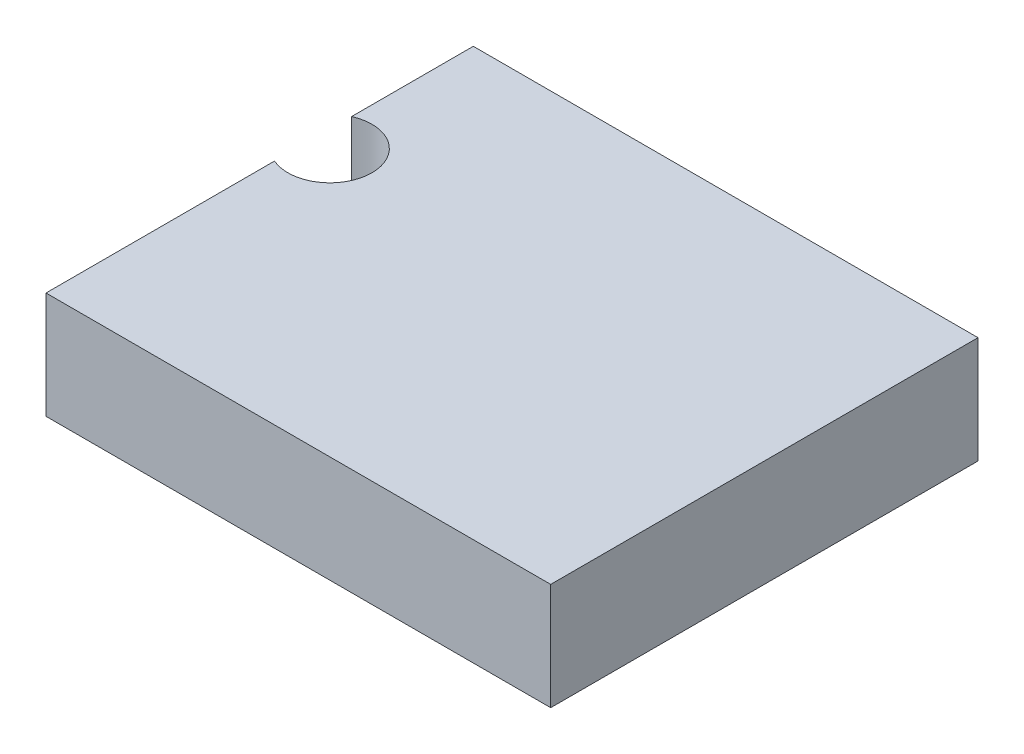
ISO-10303-21;
HEADER;
FILE_DESCRIPTION(('STEP AP214'),'2;1');
FILE_NAME('part.step','',(''),(''),'','','');
FILE_SCHEMA(('AUTOMOTIVE_DESIGN { 1 0 10303 214 1 1 1 1 }'));
ENDSEC;
DATA;
#1=APPLICATION_CONTEXT('core data for automotive mechanical design processes');
#2=APPLICATION_PROTOCOL_DEFINITION('international standard','automotive_design',2000,#1);
#3=PRODUCT_CONTEXT('',#1,'mechanical');
#4=PRODUCT('Part','Part','',(#3));
#5=PRODUCT_RELATED_PRODUCT_CATEGORY('part','',(#4));
#6=PRODUCT_DEFINITION_FORMATION('','',#4);
#7=PRODUCT_DEFINITION_CONTEXT('part definition',#1,'design');
#8=PRODUCT_DEFINITION('design','',#6,#7);
#9=PRODUCT_DEFINITION_SHAPE('','',#8);
#10=(LENGTH_UNIT() NAMED_UNIT(*) SI_UNIT(.MILLI.,.METRE.));
#11=(NAMED_UNIT(*) PLANE_ANGLE_UNIT() SI_UNIT($,.RADIAN.));
#12=(NAMED_UNIT(*) SI_UNIT($,.STERADIAN.) SOLID_ANGLE_UNIT());
#13=UNCERTAINTY_MEASURE_WITH_UNIT(LENGTH_MEASURE(1.E-05),#10,'distance_accuracy_value','');
#14=(GEOMETRIC_REPRESENTATION_CONTEXT(3) GLOBAL_UNCERTAINTY_ASSIGNED_CONTEXT((#13)) GLOBAL_UNIT_ASSIGNED_CONTEXT((#10,
#11,#12)) REPRESENTATION_CONTEXT('',''));
#15=CARTESIAN_POINT('',(0.,0.,0.));
#16=DIRECTION('',(0.,0.,1.));
#17=DIRECTION('',(1.,0.,0.));
#18=AXIS2_PLACEMENT_3D('',#15,#16,#17);
#19=CARTESIAN_POINT('',(-15.,6.35,12.7));
#20=DIRECTION('',(1.,0.,0.));
#21=DIRECTION('',(0.,0.,-1.));
#22=AXIS2_PLACEMENT_3D('',#19,#20,#21);
#23=PLANE('',#22);
#24=DIRECTION('',(0.,0.,1.));
#25=VECTOR('',#24,1.);
#26=CARTESIAN_POINT('',(-15.,0.,12.7));
#27=LINE('',#26,#25);
#28=CARTESIAN_POINT('',(-15.,0.,-12.7));
#29=VERTEX_POINT('',#28);
#30=CARTESIAN_POINT('',(-15.,0.,-5.46628784747792));
#31=VERTEX_POINT('',#30);
#32=EDGE_CURVE('E110',#29,#31,#27,.T.);
#33=ORIENTED_EDGE('',*,*,#32,.T.);
#34=DIRECTION('',(0.,1.,0.));
#35=VECTOR('',#34,1.);
#36=CARTESIAN_POINT('',(-15.,0.,-5.46628784747792));
#37=LINE('',#36,#35);
#38=CARTESIAN_POINT('',(-15.,6.35,-5.46628784747792));
#39=VERTEX_POINT('',#38);
#40=EDGE_CURVE('E47',#31,#39,#37,.T.);
#41=ORIENTED_EDGE('',*,*,#40,.T.);
#42=DIRECTION('',(0.,0.,1.));
#43=VECTOR('',#42,1.);
#44=CARTESIAN_POINT('',(-15.,6.35,12.7));
#45=LINE('',#44,#43);
#46=CARTESIAN_POINT('',(-15.,6.35,-12.7));
#47=VERTEX_POINT('',#46);
#48=EDGE_CURVE('E133',#47,#39,#45,.T.);
#49=ORIENTED_EDGE('',*,*,#48,.F.);
#50=DIRECTION('',(0.,-1.,0.));
#51=VECTOR('',#50,1.);
#52=CARTESIAN_POINT('',(-15.,6.35,-12.7));
#53=LINE('',#52,#51);
#54=EDGE_CURVE('E123',#47,#29,#53,.T.);
#55=ORIENTED_EDGE('',*,*,#54,.T.);
#56=EDGE_LOOP('',(#33,#41,#49,#55));
#57=FACE_BOUND('',#56,.T.);
#58=ADVANCED_FACE('F33',(#57),#23,.F.);
#59=CARTESIAN_POINT('',(15.,6.35,12.7));
#60=DIRECTION('',(-1.,0.,0.));
#61=DIRECTION('',(0.,0.,1.));
#62=AXIS2_PLACEMENT_3D('',#59,#60,#61);
#63=PLANE('',#62);
#64=DIRECTION('',(0.,0.,-1.));
#65=VECTOR('',#64,1.);
#66=CARTESIAN_POINT('',(15.,0.,12.7));
#67=LINE('',#66,#65);
#68=CARTESIAN_POINT('',(15.,0.,12.7));
#69=VERTEX_POINT('',#68);
#70=CARTESIAN_POINT('',(15.,0.,-12.7));
#71=VERTEX_POINT('',#70);
#72=EDGE_CURVE('E113',#69,#71,#67,.T.);
#73=ORIENTED_EDGE('',*,*,#72,.T.);
#74=DIRECTION('',(0.,-1.,0.));
#75=VECTOR('',#74,1.);
#76=CARTESIAN_POINT('',(15.,6.35,-12.7));
#77=LINE('',#76,#75);
#78=CARTESIAN_POINT('',(15.,6.35,-12.7));
#79=VERTEX_POINT('',#78);
#80=EDGE_CURVE('E41',#79,#71,#77,.T.);
#81=ORIENTED_EDGE('',*,*,#80,.F.);
#82=DIRECTION('',(0.,0.,-1.));
#83=VECTOR('',#82,1.);
#84=CARTESIAN_POINT('',(15.,6.35,12.7));
#85=LINE('',#84,#83);
#86=CARTESIAN_POINT('',(15.,6.35,12.7));
#87=VERTEX_POINT('',#86);
#88=EDGE_CURVE('E118',#87,#79,#85,.T.);
#89=ORIENTED_EDGE('',*,*,#88,.F.);
#90=DIRECTION('',(0.,-1.,0.));
#91=VECTOR('',#90,1.);
#92=CARTESIAN_POINT('',(15.,6.35,12.7));
#93=LINE('',#92,#91);
#94=EDGE_CURVE('E119',#87,#69,#93,.T.);
#95=ORIENTED_EDGE('',*,*,#94,.T.);
#96=EDGE_LOOP('',(#73,#81,#89,#95));
#97=FACE_BOUND('',#96,.T.);
#98=ADVANCED_FACE('F35',(#97),#63,.F.);
#99=CARTESIAN_POINT('',(-15.,6.35,-12.7));
#100=DIRECTION('',(0.,0.,1.));
#101=DIRECTION('',(1.,0.,0.));
#102=AXIS2_PLACEMENT_3D('',#99,#100,#101);
#103=PLANE('',#102);
#104=DIRECTION('',(-1.,0.,0.));
#105=VECTOR('',#104,1.);
#106=CARTESIAN_POINT('',(-15.,0.,-12.7));
#107=LINE('',#106,#105);
#108=EDGE_CURVE('E111',#71,#29,#107,.T.);
#109=ORIENTED_EDGE('',*,*,#108,.T.);
#110=ORIENTED_EDGE('',*,*,#54,.F.);
#111=DIRECTION('',(-1.,0.,0.));
#112=VECTOR('',#111,1.);
#113=CARTESIAN_POINT('',(-15.,6.35,-12.7));
#114=LINE('',#113,#112);
#115=EDGE_CURVE('E85',#79,#47,#114,.T.);
#116=ORIENTED_EDGE('',*,*,#115,.F.);
#117=ORIENTED_EDGE('',*,*,#80,.T.);
#118=EDGE_LOOP('',(#109,#110,#116,#117));
#119=FACE_BOUND('',#118,.T.);
#120=ADVANCED_FACE('F127',(#119),#103,.F.);
#121=CARTESIAN_POINT('',(-15.,6.35,-0.883712152522083));
#122=VERTEX_POINT('',#121);
#123=CARTESIAN_POINT('',(-15.,6.35,12.7));
#124=VERTEX_POINT('',#123);
#125=EDGE_CURVE('E105',#122,#124,#45,.T.);
#126=ORIENTED_EDGE('',*,*,#125,.F.);
#127=DIRECTION('',(0.,1.,0.));
#128=VECTOR('',#127,1.);
#129=CARTESIAN_POINT('',(-15.,0.,-0.883712152522083));
#130=LINE('',#129,#128);
#131=CARTESIAN_POINT('',(-15.,0.,-0.883712152522083));
#132=VERTEX_POINT('',#131);
#133=EDGE_CURVE('E94',#122,#132,#130,.F.);
#134=ORIENTED_EDGE('',*,*,#133,.T.);
#135=CARTESIAN_POINT('',(-15.,0.,12.7));
#136=VERTEX_POINT('',#135);
#137=EDGE_CURVE('E104',#132,#136,#27,.T.);
#138=ORIENTED_EDGE('',*,*,#137,.T.);
#139=DIRECTION('',(0.,-1.,0.));
#140=VECTOR('',#139,1.);
#141=CARTESIAN_POINT('',(-15.,6.35,12.7));
#142=LINE('',#141,#140);
#143=EDGE_CURVE('E121',#124,#136,#142,.T.);
#144=ORIENTED_EDGE('',*,*,#143,.F.);
#145=EDGE_LOOP('',(#126,#134,#138,#144));
#146=FACE_BOUND('',#145,.T.);
#147=ADVANCED_FACE('F102',(#146),#23,.F.);
#148=CARTESIAN_POINT('',(-15.,6.35,12.7));
#149=DIRECTION('',(0.,0.,-1.));
#150=DIRECTION('',(-1.,0.,0.));
#151=AXIS2_PLACEMENT_3D('',#148,#149,#150);
#152=PLANE('',#151);
#153=DIRECTION('',(1.,0.,0.));
#154=VECTOR('',#153,1.);
#155=CARTESIAN_POINT('',(-15.,0.,12.7));
#156=LINE('',#155,#154);
#157=EDGE_CURVE('E77',#136,#69,#156,.T.);
#158=ORIENTED_EDGE('',*,*,#157,.T.);
#159=ORIENTED_EDGE('',*,*,#94,.F.);
#160=DIRECTION('',(1.,0.,0.));
#161=VECTOR('',#160,1.);
#162=CARTESIAN_POINT('',(-15.,6.35,12.7));
#163=LINE('',#162,#161);
#164=EDGE_CURVE('E56',#124,#87,#163,.T.);
#165=ORIENTED_EDGE('',*,*,#164,.F.);
#166=ORIENTED_EDGE('',*,*,#143,.T.);
#167=EDGE_LOOP('',(#158,#159,#165,#166));
#168=FACE_BOUND('',#167,.T.);
#169=ADVANCED_FACE('F142',(#168),#152,.F.);
#170=CARTESIAN_POINT('',(0.,6.35,0.));
#171=DIRECTION('',(0.,-1.,0.));
#172=DIRECTION('',(0.,0.,-1.));
#173=AXIS2_PLACEMENT_3D('',#170,#171,#172);
#174=PLANE('',#173);
#175=ORIENTED_EDGE('',*,*,#48,.T.);
#176=CARTESIAN_POINT('',(-14.,6.35,-3.175));
#177=DIRECTION('',(0.,1.,0.));
#178=DIRECTION('',(0.,0.,1.));
#179=AXIS2_PLACEMENT_3D('',#176,#177,#178);
#180=CIRCLE('',#179,2.5);
#181=EDGE_CURVE('E106',#122,#39,#180,.T.);
#182=ORIENTED_EDGE('',*,*,#181,.F.);
#183=ORIENTED_EDGE('',*,*,#125,.T.);
#184=ORIENTED_EDGE('',*,*,#164,.T.);
#185=ORIENTED_EDGE('',*,*,#88,.T.);
#186=ORIENTED_EDGE('',*,*,#115,.T.);
#187=EDGE_LOOP('',(#175,#182,#183,#184,#185,#186));
#188=FACE_BOUND('',#187,.T.);
#189=ADVANCED_FACE('F140',(#188),#174,.F.);
#190=CARTESIAN_POINT('',(0.,0.,0.));
#191=DIRECTION('',(0.,-1.,0.));
#192=DIRECTION('',(0.,0.,-1.));
#193=AXIS2_PLACEMENT_3D('',#190,#191,#192);
#194=PLANE('',#193);
#195=CARTESIAN_POINT('',(-14.,0.,-3.175));
#196=DIRECTION('',(0.,-1.,0.));
#197=DIRECTION('',(0.,0.,-1.));
#198=AXIS2_PLACEMENT_3D('',#195,#196,#197);
#199=CIRCLE('',#198,2.5);
#200=EDGE_CURVE('E11',#31,#132,#199,.T.);
#201=ORIENTED_EDGE('',*,*,#200,.F.);
#202=ORIENTED_EDGE('',*,*,#32,.F.);
#203=ORIENTED_EDGE('',*,*,#108,.F.);
#204=ORIENTED_EDGE('',*,*,#72,.F.);
#205=ORIENTED_EDGE('',*,*,#157,.F.);
#206=ORIENTED_EDGE('',*,*,#137,.F.);
#207=EDGE_LOOP('',(#201,#202,#203,#204,#205,#206));
#208=FACE_BOUND('',#207,.T.);
#209=ADVANCED_FACE('F108',(#208),#194,.T.);
#210=CARTESIAN_POINT('',(-14.,0.,-3.175));
#211=DIRECTION('',(0.,1.,0.));
#212=DIRECTION('',(0.,0.,1.));
#213=AXIS2_PLACEMENT_3D('',#210,#211,#212);
#214=CYLINDRICAL_SURFACE('',#213,2.5);
#215=ORIENTED_EDGE('',*,*,#200,.T.);
#216=ORIENTED_EDGE('',*,*,#133,.F.);
#217=ORIENTED_EDGE('',*,*,#181,.T.);
#218=ORIENTED_EDGE('',*,*,#40,.F.);
#219=EDGE_LOOP('',(#215,#216,#217,#218));
#220=FACE_BOUND('',#219,.T.);
#221=ADVANCED_FACE('F93',(#220),#214,.F.);
#222=CLOSED_SHELL('',(#58,#98,#120,#147,#169,#189,#209,#221));
#223=MANIFOLD_SOLID_BREP('B2',#222);
#224=ADVANCED_BREP_SHAPE_REPRESENTATION('',(#18,#223),#14);
#225=SHAPE_DEFINITION_REPRESENTATION(#9,#224);
ENDSEC;
END-ISO-10303-21;
